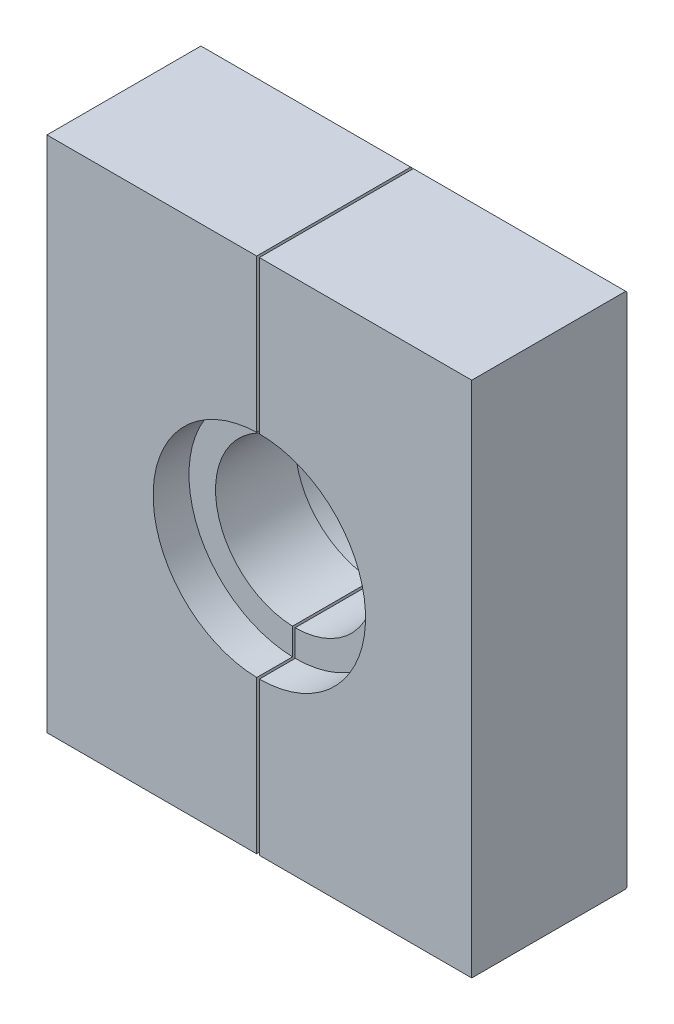
ISO-10303-21;
HEADER;
FILE_DESCRIPTION(('STEP AP214'),'2;1');
FILE_NAME('part.step','',(''),(''),'','','');
FILE_SCHEMA(('AUTOMOTIVE_DESIGN { 1 0 10303 214 1 1 1 1 }'));
ENDSEC;
DATA;
#1=APPLICATION_CONTEXT('core data for automotive mechanical design processes');
#2=APPLICATION_PROTOCOL_DEFINITION('international standard','automotive_design',2000,#1);
#3=PRODUCT_CONTEXT('',#1,'mechanical');
#4=PRODUCT('Part','Part','',(#3));
#5=PRODUCT_RELATED_PRODUCT_CATEGORY('part','',(#4));
#6=PRODUCT_DEFINITION_FORMATION('','',#4);
#7=PRODUCT_DEFINITION_CONTEXT('part definition',#1,'design');
#8=PRODUCT_DEFINITION('design','',#6,#7);
#9=PRODUCT_DEFINITION_SHAPE('','',#8);
#10=(LENGTH_UNIT() NAMED_UNIT(*) SI_UNIT(.MILLI.,.METRE.));
#11=(NAMED_UNIT(*) PLANE_ANGLE_UNIT() SI_UNIT($,.RADIAN.));
#12=(NAMED_UNIT(*) SI_UNIT($,.STERADIAN.) SOLID_ANGLE_UNIT());
#13=UNCERTAINTY_MEASURE_WITH_UNIT(LENGTH_MEASURE(1.E-05),#10,'distance_accuracy_value','');
#14=(GEOMETRIC_REPRESENTATION_CONTEXT(3) GLOBAL_UNCERTAINTY_ASSIGNED_CONTEXT((#13)) GLOBAL_UNIT_ASSIGNED_CONTEXT((#10,
#11,#12)) REPRESENTATION_CONTEXT('',''));
#15=CARTESIAN_POINT('',(0.,0.,0.));
#16=DIRECTION('',(0.,0.,1.));
#17=DIRECTION('',(1.,0.,0.));
#18=AXIS2_PLACEMENT_3D('',#15,#16,#17);
#19=CARTESIAN_POINT('',(0.,-27.,12.7));
#20=DIRECTION('',(0.,-1.,0.));
#21=DIRECTION('',(0.,0.,-1.));
#22=AXIS2_PLACEMENT_3D('',#19,#20,#21);
#23=PLANE('',#22);
#24=DIRECTION('',(0.,0.,-1.));
#25=VECTOR('',#24,1.);
#26=CARTESIAN_POINT('',(13.9184301991096,-27.,12.7));
#27=LINE('',#26,#25);
#28=CARTESIAN_POINT('',(13.9184301991096,-27.,11.7));
#29=VERTEX_POINT('',#28);
#30=CARTESIAN_POINT('',(13.9184301991096,-27.,0.0999999999999959));
#31=VERTEX_POINT('',#30);
#32=EDGE_CURVE('E164',#29,#31,#27,.T.);
#33=ORIENTED_EDGE('',*,*,#32,.F.);
#34=DIRECTION('',(-1.,0.,0.));
#35=VECTOR('',#34,1.);
#36=CARTESIAN_POINT('',(0.,-27.,11.7));
#37=LINE('',#36,#35);
#38=CARTESIAN_POINT('',(-2.0815698008904,-27.,11.7));
#39=VERTEX_POINT('',#38);
#40=EDGE_CURVE('E251',#29,#39,#37,.T.);
#41=ORIENTED_EDGE('',*,*,#40,.T.);
#42=DIRECTION('',(0.,0.,1.));
#43=VECTOR('',#42,1.);
#44=CARTESIAN_POINT('',(-2.0815698008904,-27.,0.));
#45=LINE('',#44,#43);
#46=CARTESIAN_POINT('',(-2.0815698008904,-27.,0.0999999999999959));
#47=VERTEX_POINT('',#46);
#48=EDGE_CURVE('E60',#47,#39,#45,.T.);
#49=ORIENTED_EDGE('',*,*,#48,.F.);
#50=DIRECTION('',(1.,0.,0.));
#51=VECTOR('',#50,1.);
#52=CARTESIAN_POINT('',(13.9184301991096,-27.,0.0999999999999959));
#53=LINE('',#52,#51);
#54=EDGE_CURVE('E126',#47,#31,#53,.T.);
#55=ORIENTED_EDGE('',*,*,#54,.T.);
#56=EDGE_LOOP('',(#33,#41,#49,#55));
#57=FACE_BOUND('',#56,.T.);
#58=ADVANCED_FACE('F51',(#57),#23,.T.);
#59=CARTESIAN_POINT('',(0.,12.,12.7));
#60=DIRECTION('',(0.,1.,0.));
#61=DIRECTION('',(0.,0.,1.));
#62=AXIS2_PLACEMENT_3D('',#59,#60,#61);
#63=PLANE('',#62);
#64=DIRECTION('',(0.,0.,1.));
#65=VECTOR('',#64,1.);
#66=CARTESIAN_POINT('',(-2.0815698008904,12.,0.));
#67=LINE('',#66,#65);
#68=CARTESIAN_POINT('',(-2.0815698008904,12.,0.0999999999999959));
#69=VERTEX_POINT('',#68);
#70=CARTESIAN_POINT('',(-2.0815698008904,12.,11.7));
#71=VERTEX_POINT('',#70);
#72=EDGE_CURVE('E183',#69,#71,#67,.T.);
#73=ORIENTED_EDGE('',*,*,#72,.T.);
#74=DIRECTION('',(1.,0.,0.));
#75=VECTOR('',#74,1.);
#76=CARTESIAN_POINT('',(0.,12.,11.7));
#77=LINE('',#76,#75);
#78=CARTESIAN_POINT('',(13.9184301991096,12.,11.7));
#79=VERTEX_POINT('',#78);
#80=EDGE_CURVE('E152',#71,#79,#77,.T.);
#81=ORIENTED_EDGE('',*,*,#80,.T.);
#82=DIRECTION('',(0.,0.,-1.));
#83=VECTOR('',#82,1.);
#84=CARTESIAN_POINT('',(13.9184301991096,12.,12.7));
#85=LINE('',#84,#83);
#86=CARTESIAN_POINT('',(13.9184301991096,12.,0.0999999999999959));
#87=VERTEX_POINT('',#86);
#88=EDGE_CURVE('E140',#79,#87,#85,.T.);
#89=ORIENTED_EDGE('',*,*,#88,.T.);
#90=DIRECTION('',(-1.,0.,0.));
#91=VECTOR('',#90,1.);
#92=CARTESIAN_POINT('',(-18.0815698008904,12.,0.0999999999999959));
#93=LINE('',#92,#91);
#94=EDGE_CURVE('E136',#87,#69,#93,.T.);
#95=ORIENTED_EDGE('',*,*,#94,.T.);
#96=EDGE_LOOP('',(#73,#81,#89,#95));
#97=FACE_BOUND('',#96,.T.);
#98=ADVANCED_FACE('F280',(#97),#63,.T.);
#99=CARTESIAN_POINT('',(-2.0815698008904,-7.5,9.));
#100=DIRECTION('',(0.,0.,1.));
#101=DIRECTION('',(1.,0.,0.));
#102=AXIS2_PLACEMENT_3D('',#99,#100,#101);
#103=CYLINDRICAL_SURFACE('',#102,8.);
#104=CARTESIAN_POINT('',(-2.0815698008904,-7.5,11.7));
#105=DIRECTION('',(0.,0.,1.));
#106=DIRECTION('',(1.,0.,0.));
#107=AXIS2_PLACEMENT_3D('',#104,#105,#106);
#108=CIRCLE('',#107,8.);
#109=CARTESIAN_POINT('',(-2.0815698008904,0.5,11.7));
#110=VERTEX_POINT('',#109);
#111=CARTESIAN_POINT('',(-2.0815698008904,-15.5,11.7));
#112=VERTEX_POINT('',#111);
#113=EDGE_CURVE('E66',#110,#112,#108,.F.);
#114=ORIENTED_EDGE('',*,*,#113,.F.);
#115=DIRECTION('',(0.,0.,1.));
#116=VECTOR('',#115,1.);
#117=CARTESIAN_POINT('',(-2.0815698008904,0.5,9.));
#118=LINE('',#117,#116);
#119=CARTESIAN_POINT('',(-2.0815698008904,0.5,9.));
#120=VERTEX_POINT('',#119);
#121=EDGE_CURVE('E212',#110,#120,#118,.F.);
#122=ORIENTED_EDGE('',*,*,#121,.T.);
#123=CARTESIAN_POINT('',(-2.0815698008904,-7.5,9.));
#124=DIRECTION('',(0.,0.,1.));
#125=DIRECTION('',(1.,0.,0.));
#126=AXIS2_PLACEMENT_3D('',#123,#124,#125);
#127=CIRCLE('',#126,8.);
#128=CARTESIAN_POINT('',(-2.0815698008904,-15.5,9.));
#129=VERTEX_POINT('',#128);
#130=EDGE_CURVE('E153',#129,#120,#127,.T.);
#131=ORIENTED_EDGE('',*,*,#130,.F.);
#132=DIRECTION('',(0.,0.,1.));
#133=VECTOR('',#132,1.);
#134=CARTESIAN_POINT('',(-2.0815698008904,-15.5,9.));
#135=LINE('',#134,#133);
#136=EDGE_CURVE('E74',#129,#112,#135,.T.);
#137=ORIENTED_EDGE('',*,*,#136,.T.);
#138=EDGE_LOOP('',(#114,#122,#131,#137));
#139=FACE_BOUND('',#138,.T.);
#140=ADVANCED_FACE('F246',(#139),#103,.F.);
#141=CARTESIAN_POINT('',(13.9184301991096,0.,12.7));
#142=DIRECTION('',(1.,0.,0.));
#143=DIRECTION('',(0.,1.,0.));
#144=AXIS2_PLACEMENT_3D('',#141,#142,#143);
#145=PLANE('',#144);
#146=ORIENTED_EDGE('',*,*,#88,.F.);
#147=DIRECTION('',(0.,-1.,0.));
#148=VECTOR('',#147,1.);
#149=CARTESIAN_POINT('',(13.9184301991096,0.,11.7));
#150=LINE('',#149,#148);
#151=EDGE_CURVE('E260',#79,#29,#150,.T.);
#152=ORIENTED_EDGE('',*,*,#151,.T.);
#153=ORIENTED_EDGE('',*,*,#32,.T.);
#154=DIRECTION('',(0.,0.707106781186548,-0.707106781186548));
#155=VECTOR('',#154,1.);
#156=CARTESIAN_POINT('',(13.9184301991096,-19.8,-7.1));
#157=LINE('',#156,#155);
#158=CARTESIAN_POINT('',(13.9184301991096,-26.9,0.));
#159=VERTEX_POINT('',#158);
#160=EDGE_CURVE('E206',#31,#159,#157,.T.);
#161=ORIENTED_EDGE('',*,*,#160,.T.);
#162=DIRECTION('',(0.,-1.,0.));
#163=VECTOR('',#162,1.);
#164=CARTESIAN_POINT('',(13.9184301991096,0.,0.));
#165=LINE('',#164,#163);
#166=CARTESIAN_POINT('',(13.9184301991096,11.9,0.));
#167=VERTEX_POINT('',#166);
#168=EDGE_CURVE('E134',#167,#159,#165,.T.);
#169=ORIENTED_EDGE('',*,*,#168,.F.);
#170=DIRECTION('',(0.,0.707106781186548,0.707106781186548));
#171=VECTOR('',#170,1.);
#172=CARTESIAN_POINT('',(13.9184301991096,12.3,0.399999999999999));
#173=LINE('',#172,#171);
#174=EDGE_CURVE('E199',#167,#87,#173,.T.);
#175=ORIENTED_EDGE('',*,*,#174,.T.);
#176=EDGE_LOOP('',(#146,#152,#153,#161,#169,#175));
#177=FACE_BOUND('',#176,.T.);
#178=ADVANCED_FACE('F209',(#177),#145,.T.);
#179=CARTESIAN_POINT('',(-2.0815698008904,12.,0.));
#180=DIRECTION('',(1.,0.,0.));
#181=DIRECTION('',(0.,1.,0.));
#182=AXIS2_PLACEMENT_3D('',#179,#180,#181);
#183=PLANE('',#182);
#184=DIRECTION('',(0.,-1.,0.));
#185=VECTOR('',#184,1.);
#186=CARTESIAN_POINT('',(-2.0815698008904,12.,11.7));
#187=LINE('',#186,#185);
#188=EDGE_CURVE('E255',#71,#110,#187,.T.);
#189=ORIENTED_EDGE('',*,*,#188,.F.);
#190=ORIENTED_EDGE('',*,*,#72,.F.);
#191=DIRECTION('',(0.,-0.707106781186548,-0.707106781186548));
#192=VECTOR('',#191,1.);
#193=CARTESIAN_POINT('',(-2.0815698008904,11.9,0.));
#194=LINE('',#193,#192);
#195=CARTESIAN_POINT('',(-2.0815698008904,11.9,0.));
#196=VERTEX_POINT('',#195);
#197=EDGE_CURVE('E197',#69,#196,#194,.T.);
#198=ORIENTED_EDGE('',*,*,#197,.T.);
#199=DIRECTION('',(0.,1.,0.));
#200=VECTOR('',#199,1.);
#201=CARTESIAN_POINT('',(-2.0815698008904,12.,0.));
#202=LINE('',#201,#200);
#203=CARTESIAN_POINT('',(-2.0815698008904,0.500000000000002,0.));
#204=VERTEX_POINT('',#203);
#205=EDGE_CURVE('E116',#204,#196,#202,.T.);
#206=ORIENTED_EDGE('',*,*,#205,.F.);
#207=DIRECTION('',(0.,0.,-1.));
#208=VECTOR('',#207,1.);
#209=CARTESIAN_POINT('',(-2.0815698008904,0.500000000000002,3.));
#210=LINE('',#209,#208);
#211=CARTESIAN_POINT('',(-2.0815698008904,0.500000000000002,3.));
#212=VERTEX_POINT('',#211);
#213=EDGE_CURVE('E165',#212,#204,#210,.T.);
#214=ORIENTED_EDGE('',*,*,#213,.F.);
#215=DIRECTION('',(0.,-1.,0.));
#216=VECTOR('',#215,1.);
#217=CARTESIAN_POINT('',(-2.0815698008904,-7.5,3.));
#218=LINE('',#217,#216);
#219=CARTESIAN_POINT('',(-2.0815698008904,-1.5,3.));
#220=VERTEX_POINT('',#219);
#221=EDGE_CURVE('E179',#212,#220,#218,.T.);
#222=ORIENTED_EDGE('',*,*,#221,.T.);
#223=DIRECTION('',(0.,0.,-1.));
#224=VECTOR('',#223,1.);
#225=CARTESIAN_POINT('',(-2.0815698008904,-1.5,12.7));
#226=LINE('',#225,#224);
#227=CARTESIAN_POINT('',(-2.0815698008904,-1.5,9.));
#228=VERTEX_POINT('',#227);
#229=EDGE_CURVE('E220',#220,#228,#226,.F.);
#230=ORIENTED_EDGE('',*,*,#229,.T.);
#231=DIRECTION('',(0.,1.,0.));
#232=VECTOR('',#231,1.);
#233=CARTESIAN_POINT('',(-2.0815698008904,-7.5,9.));
#234=LINE('',#233,#232);
#235=EDGE_CURVE('E223',#228,#120,#234,.T.);
#236=ORIENTED_EDGE('',*,*,#235,.T.);
#237=ORIENTED_EDGE('',*,*,#121,.F.);
#238=EDGE_LOOP('',(#189,#190,#198,#206,#214,#222,#230,#236,#237));
#239=FACE_BOUND('',#238,.T.);
#240=ADVANCED_FACE('F235',(#239),#183,.F.);
#241=DIRECTION('',(0.,-1.,0.));
#242=VECTOR('',#241,1.);
#243=CARTESIAN_POINT('',(-2.0815698008904,12.,11.7));
#244=LINE('',#243,#242);
#245=EDGE_CURVE('E12',#112,#39,#244,.T.);
#246=ORIENTED_EDGE('',*,*,#245,.F.);
#247=ORIENTED_EDGE('',*,*,#136,.F.);
#248=CARTESIAN_POINT('',(-2.0815698008904,-13.5,9.));
#249=VERTEX_POINT('',#248);
#250=EDGE_CURVE('E226',#129,#249,#234,.T.);
#251=ORIENTED_EDGE('',*,*,#250,.T.);
#252=DIRECTION('',(0.,0.,-1.));
#253=VECTOR('',#252,1.);
#254=CARTESIAN_POINT('',(-2.0815698008904,-13.5,12.7));
#255=LINE('',#254,#253);
#256=CARTESIAN_POINT('',(-2.0815698008904,-13.5,3.));
#257=VERTEX_POINT('',#256);
#258=EDGE_CURVE('E176',#249,#257,#255,.T.);
#259=ORIENTED_EDGE('',*,*,#258,.T.);
#260=CARTESIAN_POINT('',(-2.0815698008904,-15.5,3.));
#261=VERTEX_POINT('',#260);
#262=EDGE_CURVE('E128',#257,#261,#218,.T.);
#263=ORIENTED_EDGE('',*,*,#262,.T.);
#264=DIRECTION('',(0.,0.,-1.));
#265=VECTOR('',#264,1.);
#266=CARTESIAN_POINT('',(-2.0815698008904,-15.5,3.));
#267=LINE('',#266,#265);
#268=CARTESIAN_POINT('',(-2.0815698008904,-15.5,0.));
#269=VERTEX_POINT('',#268);
#270=EDGE_CURVE('E110',#269,#261,#267,.F.);
#271=ORIENTED_EDGE('',*,*,#270,.F.);
#272=CARTESIAN_POINT('',(-2.0815698008904,-26.9,0.));
#273=VERTEX_POINT('',#272);
#274=EDGE_CURVE('E103',#273,#269,#202,.T.);
#275=ORIENTED_EDGE('',*,*,#274,.F.);
#276=DIRECTION('',(0.,-0.707106781186548,0.707106781186548));
#277=VECTOR('',#276,1.);
#278=CARTESIAN_POINT('',(-2.0815698008904,-26.9,0.));
#279=LINE('',#278,#277);
#280=EDGE_CURVE('E107',#273,#47,#279,.T.);
#281=ORIENTED_EDGE('',*,*,#280,.T.);
#282=ORIENTED_EDGE('',*,*,#48,.T.);
#283=EDGE_LOOP('',(#246,#247,#251,#259,#263,#271,#275,#281,#282));
#284=FACE_BOUND('',#283,.T.);
#285=ADVANCED_FACE('F105',(#284),#183,.F.);
#286=CARTESIAN_POINT('',(-2.0815698008904,-7.5,12.7));
#287=DIRECTION('',(0.,0.,-1.));
#288=DIRECTION('',(-1.,0.,0.));
#289=AXIS2_PLACEMENT_3D('',#286,#287,#288);
#290=CYLINDRICAL_SURFACE('',#289,6.);
#291=ORIENTED_EDGE('',*,*,#258,.F.);
#292=CARTESIAN_POINT('',(-2.0815698008904,-7.5,9.));
#293=DIRECTION('',(0.,0.,1.));
#294=DIRECTION('',(1.,0.,0.));
#295=AXIS2_PLACEMENT_3D('',#292,#293,#294);
#296=CIRCLE('',#295,6.);
#297=EDGE_CURVE('E147',#249,#228,#296,.T.);
#298=ORIENTED_EDGE('',*,*,#297,.T.);
#299=ORIENTED_EDGE('',*,*,#229,.F.);
#300=CARTESIAN_POINT('',(-2.0815698008904,-7.5,3.));
#301=DIRECTION('',(0.,0.,-1.));
#302=DIRECTION('',(-1.,0.,0.));
#303=AXIS2_PLACEMENT_3D('',#300,#301,#302);
#304=CIRCLE('',#303,6.);
#305=EDGE_CURVE('E151',#220,#257,#304,.T.);
#306=ORIENTED_EDGE('',*,*,#305,.T.);
#307=EDGE_LOOP('',(#291,#298,#299,#306));
#308=FACE_BOUND('',#307,.T.);
#309=ADVANCED_FACE('F53',(#308),#290,.F.);
#310=CARTESIAN_POINT('',(0.,0.,0.));
#311=DIRECTION('',(0.,0.,1.));
#312=DIRECTION('',(1.,0.,0.));
#313=AXIS2_PLACEMENT_3D('',#310,#311,#312);
#314=PLANE('',#313);
#315=DIRECTION('',(-1.,0.,0.));
#316=VECTOR('',#315,1.);
#317=CARTESIAN_POINT('',(-18.0815698008904,-26.9,0.));
#318=LINE('',#317,#316);
#319=EDGE_CURVE('E117',#159,#273,#318,.T.);
#320=ORIENTED_EDGE('',*,*,#319,.T.);
#321=ORIENTED_EDGE('',*,*,#274,.T.);
#322=CARTESIAN_POINT('',(-2.0815698008904,-7.5,0.));
#323=DIRECTION('',(0.,0.,-1.));
#324=DIRECTION('',(-1.,0.,0.));
#325=AXIS2_PLACEMENT_3D('',#322,#323,#324);
#326=CIRCLE('',#325,8.);
#327=EDGE_CURVE('E157',#204,#269,#326,.T.);
#328=ORIENTED_EDGE('',*,*,#327,.F.);
#329=ORIENTED_EDGE('',*,*,#205,.T.);
#330=DIRECTION('',(1.,0.,0.));
#331=VECTOR('',#330,1.);
#332=CARTESIAN_POINT('',(13.9184301991096,11.9,0.));
#333=LINE('',#332,#331);
#334=EDGE_CURVE('E144',#196,#167,#333,.T.);
#335=ORIENTED_EDGE('',*,*,#334,.T.);
#336=ORIENTED_EDGE('',*,*,#168,.T.);
#337=EDGE_LOOP('',(#320,#321,#328,#329,#335,#336));
#338=FACE_BOUND('',#337,.T.);
#339=ADVANCED_FACE('F131',(#338),#314,.F.);
#340=CARTESIAN_POINT('',(-2.0815698008904,-7.5,9.));
#341=DIRECTION('',(0.,0.,1.));
#342=DIRECTION('',(1.,0.,0.));
#343=AXIS2_PLACEMENT_3D('',#340,#341,#342);
#344=PLANE('',#343);
#345=ORIENTED_EDGE('',*,*,#250,.F.);
#346=ORIENTED_EDGE('',*,*,#130,.T.);
#347=ORIENTED_EDGE('',*,*,#235,.F.);
#348=ORIENTED_EDGE('',*,*,#297,.F.);
#349=EDGE_LOOP('',(#345,#346,#347,#348));
#350=FACE_BOUND('',#349,.T.);
#351=ADVANCED_FACE('F244',(#350),#344,.T.);
#352=CARTESIAN_POINT('',(-2.0815698008904,-7.5,3.));
#353=DIRECTION('',(0.,0.,-1.));
#354=DIRECTION('',(-1.,0.,0.));
#355=AXIS2_PLACEMENT_3D('',#352,#353,#354);
#356=CYLINDRICAL_SURFACE('',#355,8.);
#357=ORIENTED_EDGE('',*,*,#327,.T.);
#358=ORIENTED_EDGE('',*,*,#270,.T.);
#359=CARTESIAN_POINT('',(-2.0815698008904,-7.5,3.));
#360=DIRECTION('',(0.,0.,-1.));
#361=DIRECTION('',(-1.,0.,0.));
#362=AXIS2_PLACEMENT_3D('',#359,#360,#361);
#363=CIRCLE('',#362,8.);
#364=EDGE_CURVE('E161',#212,#261,#363,.T.);
#365=ORIENTED_EDGE('',*,*,#364,.F.);
#366=ORIENTED_EDGE('',*,*,#213,.T.);
#367=EDGE_LOOP('',(#357,#358,#365,#366));
#368=FACE_BOUND('',#367,.T.);
#369=ADVANCED_FACE('F299',(#368),#356,.F.);
#370=CARTESIAN_POINT('',(-2.0815698008904,-7.5,3.));
#371=DIRECTION('',(0.,0.,-1.));
#372=DIRECTION('',(-1.,0.,0.));
#373=AXIS2_PLACEMENT_3D('',#370,#371,#372);
#374=PLANE('',#373);
#375=ORIENTED_EDGE('',*,*,#221,.F.);
#376=ORIENTED_EDGE('',*,*,#364,.T.);
#377=ORIENTED_EDGE('',*,*,#262,.F.);
#378=ORIENTED_EDGE('',*,*,#305,.F.);
#379=EDGE_LOOP('',(#375,#376,#377,#378));
#380=FACE_BOUND('',#379,.T.);
#381=ADVANCED_FACE('F296',(#380),#374,.T.);
#382=CARTESIAN_POINT('',(0.,-26.9,0.));
#383=DIRECTION('',(0.,-0.707106781186548,-0.707106781186548));
#384=DIRECTION('',(1.,0.,0.));
#385=AXIS2_PLACEMENT_3D('',#382,#383,#384);
#386=PLANE('',#385);
#387=ORIENTED_EDGE('',*,*,#280,.F.);
#388=ORIENTED_EDGE('',*,*,#319,.F.);
#389=ORIENTED_EDGE('',*,*,#160,.F.);
#390=ORIENTED_EDGE('',*,*,#54,.F.);
#391=EDGE_LOOP('',(#387,#388,#389,#390));
#392=FACE_BOUND('',#391,.T.);
#393=ADVANCED_FACE('F122',(#392),#386,.T.);
#394=CARTESIAN_POINT('',(0.,11.9,0.));
#395=DIRECTION('',(0.,0.707106781186548,-0.707106781186548));
#396=DIRECTION('',(-1.,0.,0.));
#397=AXIS2_PLACEMENT_3D('',#394,#395,#396);
#398=PLANE('',#397);
#399=ORIENTED_EDGE('',*,*,#197,.F.);
#400=ORIENTED_EDGE('',*,*,#94,.F.);
#401=ORIENTED_EDGE('',*,*,#174,.F.);
#402=ORIENTED_EDGE('',*,*,#334,.F.);
#403=EDGE_LOOP('',(#399,#400,#401,#402));
#404=FACE_BOUND('',#403,.T.);
#405=ADVANCED_FACE('F195',(#404),#398,.T.);
#406=CARTESIAN_POINT('',(0.,0.,11.7));
#407=DIRECTION('',(0.,0.,1.));
#408=DIRECTION('',(1.,0.,0.));
#409=AXIS2_PLACEMENT_3D('',#406,#407,#408);
#410=PLANE('',#409);
#411=ORIENTED_EDGE('',*,*,#188,.T.);
#412=ORIENTED_EDGE('',*,*,#113,.T.);
#413=ORIENTED_EDGE('',*,*,#245,.T.);
#414=ORIENTED_EDGE('',*,*,#40,.F.);
#415=ORIENTED_EDGE('',*,*,#151,.F.);
#416=ORIENTED_EDGE('',*,*,#80,.F.);
#417=EDGE_LOOP('',(#411,#412,#413,#414,#415,#416));
#418=FACE_BOUND('',#417,.T.);
#419=ADVANCED_FACE('F317',(#418),#410,.T.);
#420=CLOSED_SHELL('',(#58,#98,#140,#178,#240,#285,#309,#339,#351,#369,#381,#393,#405,#419));
#421=MANIFOLD_SOLID_BREP('B2',#420);
#422=CARTESIAN_POINT('',(-18.0815698008904,0.,12.7));
#423=DIRECTION('',(-1.,0.,0.));
#424=DIRECTION('',(0.,0.,1.));
#425=AXIS2_PLACEMENT_3D('',#422,#423,#424);
#426=PLANE('',#425);
#427=DIRECTION('',(0.,0.,-1.));
#428=VECTOR('',#427,1.);
#429=CARTESIAN_POINT('',(-18.0815698008904,-27.,12.7));
#430=LINE('',#429,#428);
#431=CARTESIAN_POINT('',(-18.0815698008904,-27.,11.7));
#432=VERTEX_POINT('',#431);
#433=CARTESIAN_POINT('',(-18.0815698008904,-27.,0.0999999999999959));
#434=VERTEX_POINT('',#433);
#435=EDGE_CURVE('E543',#432,#434,#430,.T.);
#436=ORIENTED_EDGE('',*,*,#435,.F.);
#437=DIRECTION('',(0.,1.,0.));
#438=VECTOR('',#437,1.);
#439=CARTESIAN_POINT('',(-18.0815698008904,0.,11.7));
#440=LINE('',#439,#438);
#441=CARTESIAN_POINT('',(-18.0815698008904,12.,11.7));
#442=VERTEX_POINT('',#441);
#443=EDGE_CURVE('E517',#432,#442,#440,.T.);
#444=ORIENTED_EDGE('',*,*,#443,.T.);
#445=DIRECTION('',(0.,0.,-1.));
#446=VECTOR('',#445,1.);
#447=CARTESIAN_POINT('',(-18.0815698008904,12.,12.7));
#448=LINE('',#447,#446);
#449=CARTESIAN_POINT('',(-18.0815698008904,12.,0.0999999999999959));
#450=VERTEX_POINT('',#449);
#451=EDGE_CURVE('E545',#442,#450,#448,.T.);
#452=ORIENTED_EDGE('',*,*,#451,.T.);
#453=DIRECTION('',(0.,-0.707106781186548,-0.707106781186548));
#454=VECTOR('',#453,1.);
#455=CARTESIAN_POINT('',(-18.0815698008904,12.3,0.399999999999999));
#456=LINE('',#455,#454);
#457=CARTESIAN_POINT('',(-18.0815698008904,11.9,0.));
#458=VERTEX_POINT('',#457);
#459=EDGE_CURVE('E556',#450,#458,#456,.T.);
#460=ORIENTED_EDGE('',*,*,#459,.T.);
#461=DIRECTION('',(0.,1.,0.));
#462=VECTOR('',#461,1.);
#463=CARTESIAN_POINT('',(-18.0815698008904,0.,0.));
#464=LINE('',#463,#462);
#465=CARTESIAN_POINT('',(-18.0815698008904,-26.9,0.));
#466=VERTEX_POINT('',#465);
#467=EDGE_CURVE('E540',#466,#458,#464,.T.);
#468=ORIENTED_EDGE('',*,*,#467,.F.);
#469=DIRECTION('',(0.,-0.707106781186548,0.707106781186548));
#470=VECTOR('',#469,1.);
#471=CARTESIAN_POINT('',(-18.0815698008904,-19.8,-7.1));
#472=LINE('',#471,#470);
#473=EDGE_CURVE('E558',#466,#434,#472,.T.);
#474=ORIENTED_EDGE('',*,*,#473,.T.);
#475=EDGE_LOOP('',(#436,#444,#452,#460,#468,#474));
#476=FACE_BOUND('',#475,.T.);
#477=ADVANCED_FACE('F418',(#476),#426,.T.);
#478=CARTESIAN_POINT('',(-2.0815698008904,-7.5,9.));
#479=DIRECTION('',(0.,0.,1.));
#480=DIRECTION('',(1.,0.,0.));
#481=AXIS2_PLACEMENT_3D('',#478,#479,#480);
#482=CYLINDRICAL_SURFACE('',#481,8.);
#483=CARTESIAN_POINT('',(-2.0815698008904,-7.5,11.7));
#484=DIRECTION('',(0.,0.,1.));
#485=DIRECTION('',(1.,0.,0.));
#486=AXIS2_PLACEMENT_3D('',#483,#484,#485);
#487=CIRCLE('',#486,8.);
#488=CARTESIAN_POINT('',(-2.2815698008904,-15.4974996092529,11.7));
#489=VERTEX_POINT('',#488);
#490=CARTESIAN_POINT('',(-2.2815698008904,0.497499609252883,11.7));
#491=VERTEX_POINT('',#490);
#492=EDGE_CURVE('E505',#489,#491,#487,.F.);
#493=ORIENTED_EDGE('',*,*,#492,.F.);
#494=DIRECTION('',(0.,0.,1.));
#495=VECTOR('',#494,1.);
#496=CARTESIAN_POINT('',(-2.2815698008904,-15.4974996092529,9.));
#497=LINE('',#496,#495);
#498=CARTESIAN_POINT('',(-2.2815698008904,-15.4974996092529,9.));
#499=VERTEX_POINT('',#498);
#500=EDGE_CURVE('E514',#489,#499,#497,.F.);
#501=ORIENTED_EDGE('',*,*,#500,.T.);
#502=CARTESIAN_POINT('',(-2.0815698008904,-7.5,9.));
#503=DIRECTION('',(0.,0.,1.));
#504=DIRECTION('',(1.,0.,0.));
#505=AXIS2_PLACEMENT_3D('',#502,#503,#504);
#506=CIRCLE('',#505,8.);
#507=CARTESIAN_POINT('',(-2.2815698008904,0.497499609252883,9.));
#508=VERTEX_POINT('',#507);
#509=EDGE_CURVE('E537',#508,#499,#506,.T.);
#510=ORIENTED_EDGE('',*,*,#509,.F.);
#511=DIRECTION('',(0.,0.,1.));
#512=VECTOR('',#511,1.);
#513=CARTESIAN_POINT('',(-2.2815698008904,0.497499609252883,9.));
#514=LINE('',#513,#512);
#515=EDGE_CURVE('E516',#508,#491,#514,.T.);
#516=ORIENTED_EDGE('',*,*,#515,.T.);
#517=EDGE_LOOP('',(#493,#501,#510,#516));
#518=FACE_BOUND('',#517,.T.);
#519=ADVANCED_FACE('F512',(#518),#482,.F.);
#520=CARTESIAN_POINT('',(0.,12.,12.7));
#521=DIRECTION('',(0.,1.,0.));
#522=DIRECTION('',(0.,0.,1.));
#523=AXIS2_PLACEMENT_3D('',#520,#521,#522);
#524=PLANE('',#523);
#525=ORIENTED_EDGE('',*,*,#451,.F.);
#526=DIRECTION('',(1.,0.,0.));
#527=VECTOR('',#526,1.);
#528=CARTESIAN_POINT('',(0.,12.,11.7));
#529=LINE('',#528,#527);
#530=CARTESIAN_POINT('',(-2.2815698008904,12.,11.7));
#531=VERTEX_POINT('',#530);
#532=EDGE_CURVE('E578',#442,#531,#529,.T.);
#533=ORIENTED_EDGE('',*,*,#532,.T.);
#534=DIRECTION('',(0.,0.,1.));
#535=VECTOR('',#534,1.);
#536=CARTESIAN_POINT('',(-2.2815698008904,12.,0.));
#537=LINE('',#536,#535);
#538=CARTESIAN_POINT('',(-2.2815698008904,12.,0.099999999999996));
#539=VERTEX_POINT('',#538);
#540=EDGE_CURVE('E569',#539,#531,#537,.T.);
#541=ORIENTED_EDGE('',*,*,#540,.F.);
#542=DIRECTION('',(-1.,0.,0.));
#543=VECTOR('',#542,1.);
#544=CARTESIAN_POINT('',(-18.0815698008904,12.,0.0999999999999959));
#545=LINE('',#544,#543);
#546=EDGE_CURVE('E564',#539,#450,#545,.T.);
#547=ORIENTED_EDGE('',*,*,#546,.T.);
#548=EDGE_LOOP('',(#525,#533,#541,#547));
#549=FACE_BOUND('',#548,.T.);
#550=ADVANCED_FACE('F576',(#549),#524,.T.);
#551=CARTESIAN_POINT('',(0.,-27.,12.7));
#552=DIRECTION('',(0.,-1.,0.));
#553=DIRECTION('',(0.,0.,-1.));
#554=AXIS2_PLACEMENT_3D('',#551,#552,#553);
#555=PLANE('',#554);
#556=DIRECTION('',(0.,0.,1.));
#557=VECTOR('',#556,1.);
#558=CARTESIAN_POINT('',(-2.2815698008904,-27.,0.));
#559=LINE('',#558,#557);
#560=CARTESIAN_POINT('',(-2.2815698008904,-27.,0.0999999999999959));
#561=VERTEX_POINT('',#560);
#562=CARTESIAN_POINT('',(-2.2815698008904,-27.,11.7));
#563=VERTEX_POINT('',#562);
#564=EDGE_CURVE('E579',#561,#563,#559,.T.);
#565=ORIENTED_EDGE('',*,*,#564,.T.);
#566=DIRECTION('',(-1.,0.,0.));
#567=VECTOR('',#566,1.);
#568=CARTESIAN_POINT('',(0.,-27.,11.7));
#569=LINE('',#568,#567);
#570=EDGE_CURVE('E432',#563,#432,#569,.T.);
#571=ORIENTED_EDGE('',*,*,#570,.T.);
#572=ORIENTED_EDGE('',*,*,#435,.T.);
#573=DIRECTION('',(1.,0.,0.));
#574=VECTOR('',#573,1.);
#575=CARTESIAN_POINT('',(13.9184301991096,-27.,0.0999999999999959));
#576=LINE('',#575,#574);
#577=EDGE_CURVE('E561',#434,#561,#576,.T.);
#578=ORIENTED_EDGE('',*,*,#577,.T.);
#579=EDGE_LOOP('',(#565,#571,#572,#578));
#580=FACE_BOUND('',#579,.T.);
#581=ADVANCED_FACE('F597',(#580),#555,.T.);
#582=CARTESIAN_POINT('',(-2.2815698008904,-27.,0.));
#583=DIRECTION('',(-1.,0.,0.));
#584=DIRECTION('',(0.,-1.,0.));
#585=AXIS2_PLACEMENT_3D('',#582,#583,#584);
#586=PLANE('',#585);
#587=DIRECTION('',(0.,1.,0.));
#588=VECTOR('',#587,1.);
#589=CARTESIAN_POINT('',(-2.2815698008904,-27.,11.7));
#590=LINE('',#589,#588);
#591=EDGE_CURVE('E601',#491,#531,#590,.T.);
#592=ORIENTED_EDGE('',*,*,#591,.F.);
#593=ORIENTED_EDGE('',*,*,#515,.F.);
#594=DIRECTION('',(0.,-1.,0.));
#595=VECTOR('',#594,1.);
#596=CARTESIAN_POINT('',(-2.2815698008904,-7.5,9.));
#597=LINE('',#596,#595);
#598=CARTESIAN_POINT('',(-2.2815698008904,-1.50333425977402,9.));
#599=VERTEX_POINT('',#598);
#600=EDGE_CURVE('E530',#508,#599,#597,.T.);
#601=ORIENTED_EDGE('',*,*,#600,.T.);
#602=DIRECTION('',(0.,0.,-1.));
#603=VECTOR('',#602,1.);
#604=CARTESIAN_POINT('',(-2.2815698008904,-1.50333425977402,12.7));
#605=LINE('',#604,#603);
#606=CARTESIAN_POINT('',(-2.2815698008904,-1.50333425977402,3.));
#607=VERTEX_POINT('',#606);
#608=EDGE_CURVE('E614',#599,#607,#605,.T.);
#609=ORIENTED_EDGE('',*,*,#608,.T.);
#610=DIRECTION('',(0.,1.,0.));
#611=VECTOR('',#610,1.);
#612=CARTESIAN_POINT('',(-2.2815698008904,-7.5,3.));
#613=LINE('',#612,#611);
#614=CARTESIAN_POINT('',(-2.2815698008904,0.497499609252884,3.));
#615=VERTEX_POINT('',#614);
#616=EDGE_CURVE('E608',#607,#615,#613,.T.);
#617=ORIENTED_EDGE('',*,*,#616,.T.);
#618=DIRECTION('',(0.,0.,-1.));
#619=VECTOR('',#618,1.);
#620=CARTESIAN_POINT('',(-2.2815698008904,0.497499609252884,3.));
#621=LINE('',#620,#619);
#622=CARTESIAN_POINT('',(-2.2815698008904,0.497499609252884,0.));
#623=VERTEX_POINT('',#622);
#624=EDGE_CURVE('E610',#623,#615,#621,.F.);
#625=ORIENTED_EDGE('',*,*,#624,.F.);
#626=DIRECTION('',(0.,-1.,0.));
#627=VECTOR('',#626,1.);
#628=CARTESIAN_POINT('',(-2.2815698008904,-27.,0.));
#629=LINE('',#628,#627);
#630=CARTESIAN_POINT('',(-2.2815698008904,11.9,0.));
#631=VERTEX_POINT('',#630);
#632=EDGE_CURVE('E440',#631,#623,#629,.T.);
#633=ORIENTED_EDGE('',*,*,#632,.F.);
#634=DIRECTION('',(0.,0.707106781186548,0.707106781186548));
#635=VECTOR('',#634,1.);
#636=CARTESIAN_POINT('',(-2.2815698008904,11.9,0.));
#637=LINE('',#636,#635);
#638=EDGE_CURVE('E426',#631,#539,#637,.T.);
#639=ORIENTED_EDGE('',*,*,#638,.T.);
#640=ORIENTED_EDGE('',*,*,#540,.T.);
#641=EDGE_LOOP('',(#592,#593,#601,#609,#617,#625,#633,#639,#640));
#642=FACE_BOUND('',#641,.T.);
#643=ADVANCED_FACE('F568',(#642),#586,.F.);
#644=DIRECTION('',(0.,1.,0.));
#645=VECTOR('',#644,1.);
#646=CARTESIAN_POINT('',(-2.2815698008904,-27.,11.7));
#647=LINE('',#646,#645);
#648=EDGE_CURVE('E49',#563,#489,#647,.T.);
#649=ORIENTED_EDGE('',*,*,#648,.F.);
#650=ORIENTED_EDGE('',*,*,#564,.F.);
#651=DIRECTION('',(0.,0.707106781186548,-0.707106781186548));
#652=VECTOR('',#651,1.);
#653=CARTESIAN_POINT('',(-2.2815698008904,-26.9,0.));
#654=LINE('',#653,#652);
#655=CARTESIAN_POINT('',(-2.2815698008904,-26.9,0.));
#656=VERTEX_POINT('',#655);
#657=EDGE_CURVE('E605',#561,#656,#654,.T.);
#658=ORIENTED_EDGE('',*,*,#657,.T.);
#659=CARTESIAN_POINT('',(-2.2815698008904,-15.4974996092529,0.));
#660=VERTEX_POINT('',#659);
#661=EDGE_CURVE('E591',#660,#656,#629,.T.);
#662=ORIENTED_EDGE('',*,*,#661,.F.);
#663=DIRECTION('',(0.,0.,-1.));
#664=VECTOR('',#663,1.);
#665=CARTESIAN_POINT('',(-2.2815698008904,-15.4974996092529,3.));
#666=LINE('',#665,#664);
#667=CARTESIAN_POINT('',(-2.2815698008904,-15.4974996092529,3.));
#668=VERTEX_POINT('',#667);
#669=EDGE_CURVE('E616',#668,#660,#666,.T.);
#670=ORIENTED_EDGE('',*,*,#669,.F.);
#671=CARTESIAN_POINT('',(-2.2815698008904,-13.496665740226,3.));
#672=VERTEX_POINT('',#671);
#673=EDGE_CURVE('E611',#668,#672,#613,.T.);
#674=ORIENTED_EDGE('',*,*,#673,.T.);
#675=DIRECTION('',(0.,0.,-1.));
#676=VECTOR('',#675,1.);
#677=CARTESIAN_POINT('',(-2.2815698008904,-13.496665740226,12.7));
#678=LINE('',#677,#676);
#679=CARTESIAN_POINT('',(-2.2815698008904,-13.496665740226,9.));
#680=VERTEX_POINT('',#679);
#681=EDGE_CURVE('E528',#672,#680,#678,.F.);
#682=ORIENTED_EDGE('',*,*,#681,.T.);
#683=EDGE_CURVE('E521',#680,#499,#597,.T.);
#684=ORIENTED_EDGE('',*,*,#683,.T.);
#685=ORIENTED_EDGE('',*,*,#500,.F.);
#686=EDGE_LOOP('',(#649,#650,#658,#662,#670,#674,#682,#684,#685));
#687=FACE_BOUND('',#686,.T.);
#688=ADVANCED_FACE('F519',(#687),#586,.F.);
#689=CARTESIAN_POINT('',(-2.0815698008904,-7.5,9.));
#690=DIRECTION('',(0.,0.,1.));
#691=DIRECTION('',(1.,0.,0.));
#692=AXIS2_PLACEMENT_3D('',#689,#690,#691);
#693=PLANE('',#692);
#694=ORIENTED_EDGE('',*,*,#600,.F.);
#695=ORIENTED_EDGE('',*,*,#509,.T.);
#696=ORIENTED_EDGE('',*,*,#683,.F.);
#697=CARTESIAN_POINT('',(-2.0815698008904,-7.5,9.));
#698=DIRECTION('',(0.,0.,1.));
#699=DIRECTION('',(1.,0.,0.));
#700=AXIS2_PLACEMENT_3D('',#697,#698,#699);
#701=CIRCLE('',#700,6.);
#702=EDGE_CURVE('E539',#599,#680,#701,.T.);
#703=ORIENTED_EDGE('',*,*,#702,.F.);
#704=EDGE_LOOP('',(#694,#695,#696,#703));
#705=FACE_BOUND('',#704,.T.);
#706=ADVANCED_FACE('F652',(#705),#693,.T.);
#707=CARTESIAN_POINT('',(0.,-26.9,0.));
#708=DIRECTION('',(0.,-0.707106781186548,-0.707106781186548));
#709=DIRECTION('',(1.,0.,0.));
#710=AXIS2_PLACEMENT_3D('',#707,#708,#709);
#711=PLANE('',#710);
#712=ORIENTED_EDGE('',*,*,#657,.F.);
#713=ORIENTED_EDGE('',*,*,#577,.F.);
#714=ORIENTED_EDGE('',*,*,#473,.F.);
#715=DIRECTION('',(-1.,0.,0.));
#716=VECTOR('',#715,1.);
#717=CARTESIAN_POINT('',(-18.0815698008904,-26.9,0.));
#718=LINE('',#717,#716);
#719=EDGE_CURVE('E554',#656,#466,#718,.T.);
#720=ORIENTED_EDGE('',*,*,#719,.F.);
#721=EDGE_LOOP('',(#712,#713,#714,#720));
#722=FACE_BOUND('',#721,.T.);
#723=ADVANCED_FACE('F595',(#722),#711,.T.);
#724=CARTESIAN_POINT('',(-2.0815698008904,-7.5,3.));
#725=DIRECTION('',(0.,0.,-1.));
#726=DIRECTION('',(-1.,0.,0.));
#727=AXIS2_PLACEMENT_3D('',#724,#725,#726);
#728=PLANE('',#727);
#729=ORIENTED_EDGE('',*,*,#673,.F.);
#730=CARTESIAN_POINT('',(-2.0815698008904,-7.5,3.));
#731=DIRECTION('',(0.,0.,-1.));
#732=DIRECTION('',(-1.,0.,0.));
#733=AXIS2_PLACEMENT_3D('',#730,#731,#732);
#734=CIRCLE('',#733,8.);
#735=EDGE_CURVE('E526',#668,#615,#734,.T.);
#736=ORIENTED_EDGE('',*,*,#735,.T.);
#737=ORIENTED_EDGE('',*,*,#616,.F.);
#738=CARTESIAN_POINT('',(-2.0815698008904,-7.5,3.));
#739=DIRECTION('',(0.,0.,-1.));
#740=DIRECTION('',(-1.,0.,0.));
#741=AXIS2_PLACEMENT_3D('',#738,#739,#740);
#742=CIRCLE('',#741,6.);
#743=EDGE_CURVE('E535',#672,#607,#742,.T.);
#744=ORIENTED_EDGE('',*,*,#743,.F.);
#745=EDGE_LOOP('',(#729,#736,#737,#744));
#746=FACE_BOUND('',#745,.T.);
#747=ADVANCED_FACE('F629',(#746),#728,.T.);
#748=CARTESIAN_POINT('',(-2.0815698008904,-7.5,3.));
#749=DIRECTION('',(0.,0.,-1.));
#750=DIRECTION('',(-1.,0.,0.));
#751=AXIS2_PLACEMENT_3D('',#748,#749,#750);
#752=CYLINDRICAL_SURFACE('',#751,8.);
#753=CARTESIAN_POINT('',(-2.0815698008904,-7.5,0.));
#754=DIRECTION('',(0.,0.,-1.));
#755=DIRECTION('',(-1.,0.,0.));
#756=AXIS2_PLACEMENT_3D('',#753,#754,#755);
#757=CIRCLE('',#756,8.);
#758=EDGE_CURVE('E523',#660,#623,#757,.T.);
#759=ORIENTED_EDGE('',*,*,#758,.T.);
#760=ORIENTED_EDGE('',*,*,#624,.T.);
#761=ORIENTED_EDGE('',*,*,#735,.F.);
#762=ORIENTED_EDGE('',*,*,#669,.T.);
#763=EDGE_LOOP('',(#759,#760,#761,#762));
#764=FACE_BOUND('',#763,.T.);
#765=ADVANCED_FACE('F630',(#764),#752,.F.);
#766=CARTESIAN_POINT('',(0.,11.9,0.));
#767=DIRECTION('',(0.,0.707106781186548,-0.707106781186548));
#768=DIRECTION('',(-1.,0.,0.));
#769=AXIS2_PLACEMENT_3D('',#766,#767,#768);
#770=PLANE('',#769);
#771=ORIENTED_EDGE('',*,*,#638,.F.);
#772=DIRECTION('',(1.,0.,0.));
#773=VECTOR('',#772,1.);
#774=CARTESIAN_POINT('',(13.9184301991096,11.9,0.));
#775=LINE('',#774,#773);
#776=EDGE_CURVE('E547',#458,#631,#775,.T.);
#777=ORIENTED_EDGE('',*,*,#776,.F.);
#778=ORIENTED_EDGE('',*,*,#459,.F.);
#779=ORIENTED_EDGE('',*,*,#546,.F.);
#780=EDGE_LOOP('',(#771,#777,#778,#779));
#781=FACE_BOUND('',#780,.T.);
#782=ADVANCED_FACE('F420',(#781),#770,.T.);
#783=CARTESIAN_POINT('',(0.,0.,0.));
#784=DIRECTION('',(0.,0.,1.));
#785=DIRECTION('',(1.,0.,0.));
#786=AXIS2_PLACEMENT_3D('',#783,#784,#785);
#787=PLANE('',#786);
#788=ORIENTED_EDGE('',*,*,#776,.T.);
#789=ORIENTED_EDGE('',*,*,#632,.T.);
#790=ORIENTED_EDGE('',*,*,#758,.F.);
#791=ORIENTED_EDGE('',*,*,#661,.T.);
#792=ORIENTED_EDGE('',*,*,#719,.T.);
#793=ORIENTED_EDGE('',*,*,#467,.T.);
#794=EDGE_LOOP('',(#788,#789,#790,#791,#792,#793));
#795=FACE_BOUND('',#794,.T.);
#796=ADVANCED_FACE('F586',(#795),#787,.F.);
#797=CARTESIAN_POINT('',(-2.0815698008904,-7.5,12.7));
#798=DIRECTION('',(0.,0.,-1.));
#799=DIRECTION('',(-1.,0.,0.));
#800=AXIS2_PLACEMENT_3D('',#797,#798,#799);
#801=CYLINDRICAL_SURFACE('',#800,6.);
#802=ORIENTED_EDGE('',*,*,#608,.F.);
#803=ORIENTED_EDGE('',*,*,#702,.T.);
#804=ORIENTED_EDGE('',*,*,#681,.F.);
#805=ORIENTED_EDGE('',*,*,#743,.T.);
#806=EDGE_LOOP('',(#802,#803,#804,#805));
#807=FACE_BOUND('',#806,.T.);
#808=ADVANCED_FACE('F626',(#807),#801,.F.);
#809=CARTESIAN_POINT('',(0.,0.,11.7));
#810=DIRECTION('',(0.,0.,1.));
#811=DIRECTION('',(1.,0.,0.));
#812=AXIS2_PLACEMENT_3D('',#809,#810,#811);
#813=PLANE('',#812);
#814=ORIENTED_EDGE('',*,*,#443,.F.);
#815=ORIENTED_EDGE('',*,*,#570,.F.);
#816=ORIENTED_EDGE('',*,*,#648,.T.);
#817=ORIENTED_EDGE('',*,*,#492,.T.);
#818=ORIENTED_EDGE('',*,*,#591,.T.);
#819=ORIENTED_EDGE('',*,*,#532,.F.);
#820=EDGE_LOOP('',(#814,#815,#816,#817,#818,#819));
#821=FACE_BOUND('',#820,.T.);
#822=ADVANCED_FACE('F504',(#821),#813,.T.);
#823=CLOSED_SHELL('',(#477,#519,#550,#581,#643,#688,#706,#723,#747,#765,#782,#796,#808,#822));
#824=MANIFOLD_SOLID_BREP('B6',#823);
#825=ADVANCED_BREP_SHAPE_REPRESENTATION('',(#18,#421,#824),#14);
#826=SHAPE_DEFINITION_REPRESENTATION(#9,#825);
ENDSEC;
END-ISO-10303-21;
